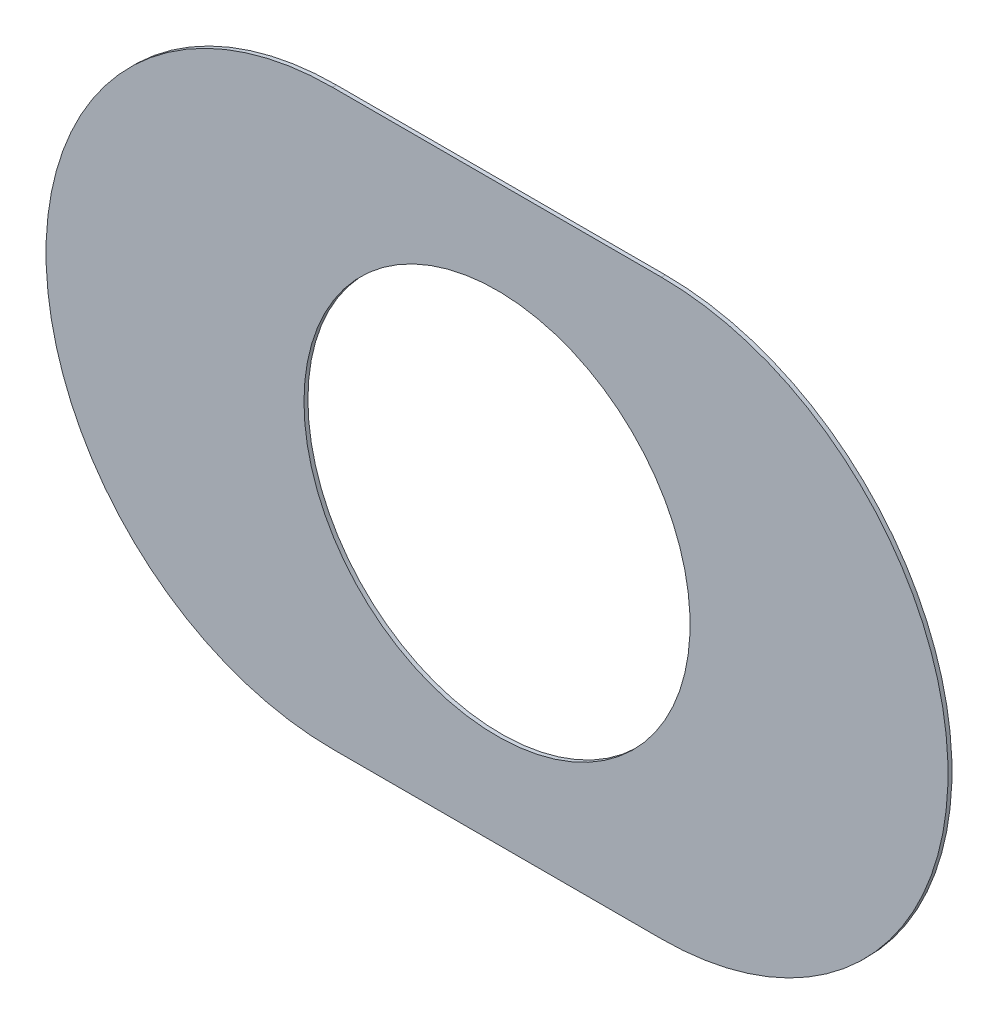
ISO-10303-21;
HEADER;
FILE_DESCRIPTION(('STEP AP214'),'2;1');
FILE_NAME('part.step','',(''),(''),'','','');
FILE_SCHEMA(('AUTOMOTIVE_DESIGN { 1 0 10303 214 1 1 1 1 }'));
ENDSEC;
DATA;
#1=APPLICATION_CONTEXT('core data for automotive mechanical design processes');
#2=APPLICATION_PROTOCOL_DEFINITION('international standard','automotive_design',2000,#1);
#3=PRODUCT_CONTEXT('',#1,'mechanical');
#4=PRODUCT('Part','Part','',(#3));
#5=PRODUCT_RELATED_PRODUCT_CATEGORY('part','',(#4));
#6=PRODUCT_DEFINITION_FORMATION('','',#4);
#7=PRODUCT_DEFINITION_CONTEXT('part definition',#1,'design');
#8=PRODUCT_DEFINITION('design','',#6,#7);
#9=PRODUCT_DEFINITION_SHAPE('','',#8);
#10=(LENGTH_UNIT() NAMED_UNIT(*) SI_UNIT(.MILLI.,.METRE.));
#11=(NAMED_UNIT(*) PLANE_ANGLE_UNIT() SI_UNIT($,.RADIAN.));
#12=(NAMED_UNIT(*) SI_UNIT($,.STERADIAN.) SOLID_ANGLE_UNIT());
#13=UNCERTAINTY_MEASURE_WITH_UNIT(LENGTH_MEASURE(1.E-05),#10,'distance_accuracy_value','');
#14=(GEOMETRIC_REPRESENTATION_CONTEXT(3) GLOBAL_UNCERTAINTY_ASSIGNED_CONTEXT((#13)) GLOBAL_UNIT_ASSIGNED_CONTEXT((#10,
#11,#12)) REPRESENTATION_CONTEXT('',''));
#15=CARTESIAN_POINT('',(0.,0.,0.));
#16=DIRECTION('',(0.,0.,1.));
#17=DIRECTION('',(1.,0.,0.));
#18=AXIS2_PLACEMENT_3D('',#15,#16,#17);
#19=CARTESIAN_POINT('',(1.54999965727325,22.1600006854535,0.));
#20=DIRECTION('',(0.,0.,-1.));
#21=DIRECTION('',(0.,-1.,0.));
#22=AXIS2_PLACEMENT_3D('',#19,#20,#21);
#23=PLANE('',#22);
#24=CARTESIAN_POINT('',(1.54999965727325,22.1600006854535,0.));
#25=DIRECTION('',(0.,0.,1.));
#26=DIRECTION('',(1.,0.,0.));
#27=AXIS2_PLACEMENT_3D('',#24,#25,#26);
#28=CIRCLE('',#27,0.49);
#29=CARTESIAN_POINT('',(1.05999965727325,22.1600006854535,0.));
#30=VERTEX_POINT('',#29);
#31=EDGE_CURVE('E118',#30,#30,#28,.T.);
#32=ORIENTED_EDGE('',*,*,#31,.F.);
#33=EDGE_LOOP('',(#32));
#34=FACE_BOUND('',#33,.T.);
#35=CARTESIAN_POINT('',(1.96740611181985,22.1600006854535,0.));
#36=DIRECTION('',(0.,0.,-1.));
#37=DIRECTION('',(0.,1.,0.));
#38=AXIS2_PLACEMENT_3D('',#35,#36,#37);
#39=CIRCLE('',#38,0.727257121659981);
#40=CARTESIAN_POINT('',(1.96740611181985,22.8872578071135,0.));
#41=VERTEX_POINT('',#40);
#42=CARTESIAN_POINT('',(1.96740611181985,21.4327435637935,0.));
#43=VERTEX_POINT('',#42);
#44=EDGE_CURVE('E27',#41,#43,#39,.T.);
#45=ORIENTED_EDGE('',*,*,#44,.F.);
#46=DIRECTION('',(1.,0.,0.));
#47=VECTOR('',#46,1.);
#48=CARTESIAN_POINT('',(1.13259320272665,22.8872578071135,0.));
#49=LINE('',#48,#47);
#50=CARTESIAN_POINT('',(1.13259320272665,22.8872578071135,0.));
#51=VERTEX_POINT('',#50);
#52=EDGE_CURVE('E100',#51,#41,#49,.T.);
#53=ORIENTED_EDGE('',*,*,#52,.F.);
#54=CARTESIAN_POINT('',(1.13259320272665,22.1600006854535,0.));
#55=DIRECTION('',(0.,0.,-1.));
#56=DIRECTION('',(0.,-1.,0.));
#57=AXIS2_PLACEMENT_3D('',#54,#55,#56);
#58=CIRCLE('',#57,0.727257121659981);
#59=CARTESIAN_POINT('',(1.13259320272665,21.4327435637935,0.));
#60=VERTEX_POINT('',#59);
#61=EDGE_CURVE('E93',#60,#51,#58,.T.);
#62=ORIENTED_EDGE('',*,*,#61,.F.);
#63=DIRECTION('',(-1.,0.,0.));
#64=VECTOR('',#63,1.);
#65=CARTESIAN_POINT('',(1.96740611181985,21.4327435637935,0.));
#66=LINE('',#65,#64);
#67=EDGE_CURVE('E80',#43,#60,#66,.T.);
#68=ORIENTED_EDGE('',*,*,#67,.F.);
#69=EDGE_LOOP('',(#45,#53,#62,#68));
#70=FACE_BOUND('',#69,.T.);
#71=ADVANCED_FACE('F17',(#34,#70),#23,.F.);
#72=CARTESIAN_POINT('',(1.54999965727325,22.1600006854535,-0.01));
#73=DIRECTION('',(0.,0.,-1.));
#74=DIRECTION('',(0.,-1.,0.));
#75=AXIS2_PLACEMENT_3D('',#72,#73,#74);
#76=PLANE('',#75);
#77=CARTESIAN_POINT('',(1.54999965727325,22.1600006854535,-0.01));
#78=DIRECTION('',(0.,0.,1.));
#79=DIRECTION('',(1.,0.,0.));
#80=AXIS2_PLACEMENT_3D('',#77,#78,#79);
#81=CIRCLE('',#80,0.49);
#82=CARTESIAN_POINT('',(1.05999965727325,22.1600006854535,-0.01));
#83=VERTEX_POINT('',#82);
#84=EDGE_CURVE('E112',#83,#83,#81,.T.);
#85=ORIENTED_EDGE('',*,*,#84,.T.);
#86=EDGE_LOOP('',(#85));
#87=FACE_BOUND('',#86,.T.);
#88=CARTESIAN_POINT('',(1.96740611181985,22.1600006854535,-0.01));
#89=DIRECTION('',(0.,0.,-1.));
#90=DIRECTION('',(0.,1.,0.));
#91=AXIS2_PLACEMENT_3D('',#88,#89,#90);
#92=CIRCLE('',#91,0.727257121659981);
#93=CARTESIAN_POINT('',(1.96740611181985,22.8872578071135,-0.01));
#94=VERTEX_POINT('',#93);
#95=CARTESIAN_POINT('',(1.96740611181985,21.4327435637935,-0.01));
#96=VERTEX_POINT('',#95);
#97=EDGE_CURVE('E11',#94,#96,#92,.T.);
#98=ORIENTED_EDGE('',*,*,#97,.T.);
#99=DIRECTION('',(-1.,0.,0.));
#100=VECTOR('',#99,1.);
#101=CARTESIAN_POINT('',(1.96740611181985,21.4327435637935,-0.01));
#102=LINE('',#101,#100);
#103=CARTESIAN_POINT('',(1.13259320272665,21.4327435637935,-0.01));
#104=VERTEX_POINT('',#103);
#105=EDGE_CURVE('E88',#96,#104,#102,.T.);
#106=ORIENTED_EDGE('',*,*,#105,.T.);
#107=CARTESIAN_POINT('',(1.13259320272665,22.1600006854535,-0.01));
#108=DIRECTION('',(0.,0.,-1.));
#109=DIRECTION('',(0.,-1.,0.));
#110=AXIS2_PLACEMENT_3D('',#107,#108,#109);
#111=CIRCLE('',#110,0.727257121659981);
#112=CARTESIAN_POINT('',(1.13259320272665,22.8872578071135,-0.01));
#113=VERTEX_POINT('',#112);
#114=EDGE_CURVE('E95',#104,#113,#111,.T.);
#115=ORIENTED_EDGE('',*,*,#114,.T.);
#116=DIRECTION('',(1.,0.,0.));
#117=VECTOR('',#116,1.);
#118=CARTESIAN_POINT('',(1.13259320272665,22.8872578071135,-0.01));
#119=LINE('',#118,#117);
#120=EDGE_CURVE('E109',#113,#94,#119,.T.);
#121=ORIENTED_EDGE('',*,*,#120,.T.);
#122=EDGE_LOOP('',(#98,#106,#115,#121));
#123=FACE_BOUND('',#122,.T.);
#124=ADVANCED_FACE('F138',(#87,#123),#76,.T.);
#125=CARTESIAN_POINT('',(1.96740611181985,22.1600006854535,0.));
#126=DIRECTION('',(0.,0.,-1.));
#127=DIRECTION('',(0.,1.,0.));
#128=AXIS2_PLACEMENT_3D('',#125,#126,#127);
#129=CYLINDRICAL_SURFACE('',#128,0.727257121659981);
#130=ORIENTED_EDGE('',*,*,#44,.T.);
#131=DIRECTION('',(0.,0.,-1.));
#132=VECTOR('',#131,1.);
#133=CARTESIAN_POINT('',(1.96740611181985,21.4327435637935,0.));
#134=LINE('',#133,#132);
#135=EDGE_CURVE('E21',#43,#96,#134,.T.);
#136=ORIENTED_EDGE('',*,*,#135,.T.);
#137=ORIENTED_EDGE('',*,*,#97,.F.);
#138=DIRECTION('',(0.,0.,-1.));
#139=VECTOR('',#138,1.);
#140=CARTESIAN_POINT('',(1.96740611181985,22.8872578071135,0.));
#141=LINE('',#140,#139);
#142=EDGE_CURVE('E117',#41,#94,#141,.T.);
#143=ORIENTED_EDGE('',*,*,#142,.F.);
#144=EDGE_LOOP('',(#130,#136,#137,#143));
#145=FACE_BOUND('',#144,.T.);
#146=ADVANCED_FACE('F136',(#145),#129,.T.);
#147=CARTESIAN_POINT('',(1.96740611181985,21.4327435637935,0.));
#148=DIRECTION('',(0.,-1.,0.));
#149=DIRECTION('',(0.,0.,-1.));
#150=AXIS2_PLACEMENT_3D('',#147,#148,#149);
#151=PLANE('',#150);
#152=ORIENTED_EDGE('',*,*,#67,.T.);
#153=DIRECTION('',(0.,0.,-1.));
#154=VECTOR('',#153,1.);
#155=CARTESIAN_POINT('',(1.13259320272665,21.4327435637935,0.));
#156=LINE('',#155,#154);
#157=EDGE_CURVE('E83',#60,#104,#156,.T.);
#158=ORIENTED_EDGE('',*,*,#157,.T.);
#159=ORIENTED_EDGE('',*,*,#105,.F.);
#160=ORIENTED_EDGE('',*,*,#135,.F.);
#161=EDGE_LOOP('',(#152,#158,#159,#160));
#162=FACE_BOUND('',#161,.T.);
#163=ADVANCED_FACE('F19',(#162),#151,.T.);
#164=CARTESIAN_POINT('',(1.13259320272665,22.1600006854535,0.));
#165=DIRECTION('',(0.,0.,-1.));
#166=DIRECTION('',(0.,-1.,0.));
#167=AXIS2_PLACEMENT_3D('',#164,#165,#166);
#168=CYLINDRICAL_SURFACE('',#167,0.727257121659981);
#169=ORIENTED_EDGE('',*,*,#61,.T.);
#170=DIRECTION('',(0.,0.,-1.));
#171=VECTOR('',#170,1.);
#172=CARTESIAN_POINT('',(1.13259320272665,22.8872578071135,0.));
#173=LINE('',#172,#171);
#174=EDGE_CURVE('E102',#51,#113,#173,.T.);
#175=ORIENTED_EDGE('',*,*,#174,.T.);
#176=ORIENTED_EDGE('',*,*,#114,.F.);
#177=ORIENTED_EDGE('',*,*,#157,.F.);
#178=EDGE_LOOP('',(#169,#175,#176,#177));
#179=FACE_BOUND('',#178,.T.);
#180=ADVANCED_FACE('F91',(#179),#168,.T.);
#181=CARTESIAN_POINT('',(1.13259320272665,22.8872578071135,0.));
#182=DIRECTION('',(0.,1.,0.));
#183=DIRECTION('',(1.,0.,0.));
#184=AXIS2_PLACEMENT_3D('',#181,#182,#183);
#185=PLANE('',#184);
#186=ORIENTED_EDGE('',*,*,#52,.T.);
#187=ORIENTED_EDGE('',*,*,#142,.T.);
#188=ORIENTED_EDGE('',*,*,#120,.F.);
#189=ORIENTED_EDGE('',*,*,#174,.F.);
#190=EDGE_LOOP('',(#186,#187,#188,#189));
#191=FACE_BOUND('',#190,.T.);
#192=ADVANCED_FACE('F140',(#191),#185,.T.);
#193=CARTESIAN_POINT('',(1.54999965727325,22.1600006854535,0.));
#194=DIRECTION('',(0.,0.,-1.));
#195=DIRECTION('',(1.,0.,0.));
#196=AXIS2_PLACEMENT_3D('',#193,#194,#195);
#197=CYLINDRICAL_SURFACE('',#196,0.49);
#198=ORIENTED_EDGE('',*,*,#84,.F.);
#199=DIRECTION('',(0.,0.,1.));
#200=VECTOR('',#199,1.);
#201=CARTESIAN_POINT('',(1.05999965727325,22.1600006854535,0.));
#202=LINE('',#201,#200);
#203=EDGE_CURVE('E114',#83,#30,#202,.T.);
#204=ORIENTED_EDGE('',*,*,#203,.T.);
#205=ORIENTED_EDGE('',*,*,#31,.T.);
#206=ORIENTED_EDGE('',*,*,#203,.F.);
#207=EDGE_LOOP('',(#198,#204,#205,#206));
#208=FACE_BOUND('',#207,.T.);
#209=ADVANCED_FACE('F142',(#208),#197,.F.);
#210=CLOSED_SHELL('',(#71,#124,#146,#163,#180,#192,#209));
#211=MANIFOLD_SOLID_BREP('B1',#210);
#212=ADVANCED_BREP_SHAPE_REPRESENTATION('',(#18,#211),#14);
#213=SHAPE_DEFINITION_REPRESENTATION(#9,#212);
ENDSEC;
END-ISO-10303-21;
